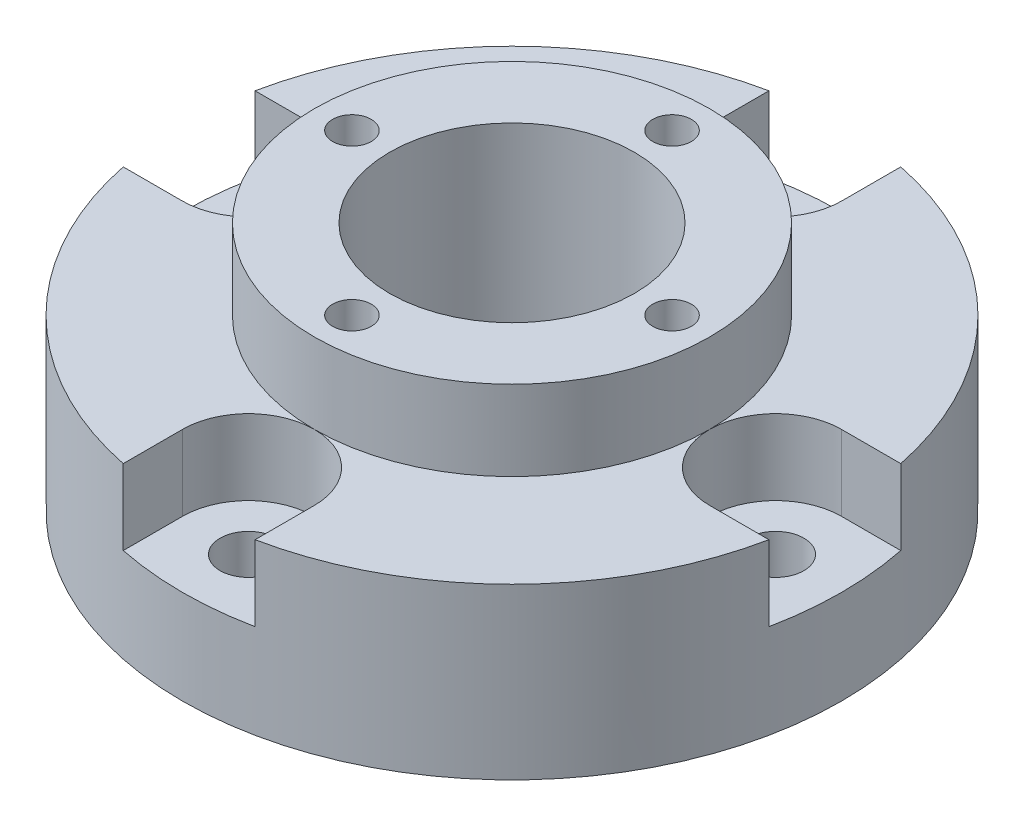
ISO-10303-21;
HEADER;
FILE_DESCRIPTION(('STEP AP214'),'2;1');
FILE_NAME('part.step','',(''),(''),'','','');
FILE_SCHEMA(('AUTOMOTIVE_DESIGN { 1 0 10303 214 1 1 1 1 }'));
ENDSEC;
DATA;
#1=APPLICATION_CONTEXT('core data for automotive mechanical design processes');
#2=APPLICATION_PROTOCOL_DEFINITION('international standard','automotive_design',2000,#1);
#3=PRODUCT_CONTEXT('',#1,'mechanical');
#4=PRODUCT('Part','Part','',(#3));
#5=PRODUCT_RELATED_PRODUCT_CATEGORY('part','',(#4));
#6=PRODUCT_DEFINITION_FORMATION('','',#4);
#7=PRODUCT_DEFINITION_CONTEXT('part definition',#1,'design');
#8=PRODUCT_DEFINITION('design','',#6,#7);
#9=PRODUCT_DEFINITION_SHAPE('','',#8);
#10=(LENGTH_UNIT() NAMED_UNIT(*) SI_UNIT(.MILLI.,.METRE.));
#11=(NAMED_UNIT(*) PLANE_ANGLE_UNIT() SI_UNIT($,.RADIAN.));
#12=(NAMED_UNIT(*) SI_UNIT($,.STERADIAN.) SOLID_ANGLE_UNIT());
#13=UNCERTAINTY_MEASURE_WITH_UNIT(LENGTH_MEASURE(1.E-05),#10,'distance_accuracy_value','');
#14=(GEOMETRIC_REPRESENTATION_CONTEXT(3) GLOBAL_UNCERTAINTY_ASSIGNED_CONTEXT((#13)) GLOBAL_UNIT_ASSIGNED_CONTEXT((#10,
#11,#12)) REPRESENTATION_CONTEXT('',''));
#15=CARTESIAN_POINT('',(0.,0.,0.));
#16=DIRECTION('',(0.,0.,1.));
#17=DIRECTION('',(1.,0.,0.));
#18=AXIS2_PLACEMENT_3D('',#15,#16,#17);
#19=CARTESIAN_POINT('',(-21.,18.,0.));
#20=DIRECTION('',(0.,-1.,0.));
#21=DIRECTION('',(0.,0.,-1.));
#22=AXIS2_PLACEMENT_3D('',#19,#20,#21);
#23=PLANE('',#22);
#24=CARTESIAN_POINT('',(-28.,18.,0.));
#25=DIRECTION('',(0.,1.,0.));
#26=DIRECTION('',(0.,0.,-1.));
#27=AXIS2_PLACEMENT_3D('',#24,#25,#26);
#28=CIRCLE('',#27,7.);
#29=CARTESIAN_POINT('',(-28.,18.,7.));
#30=VERTEX_POINT('',#29);
#31=CARTESIAN_POINT('',(-21.,18.,0.));
#32=VERTEX_POINT('',#31);
#33=EDGE_CURVE('E186',#30,#32,#28,.T.);
#34=ORIENTED_EDGE('',*,*,#33,.F.);
#35=DIRECTION('',(1.,0.,0.));
#36=VECTOR('',#35,1.);
#37=CARTESIAN_POINT('',(-28.,18.,7.));
#38=LINE('',#37,#36);
#39=CARTESIAN_POINT('',(-34.2928563989645,18.,7.));
#40=VERTEX_POINT('',#39);
#41=EDGE_CURVE('E180',#40,#30,#38,.T.);
#42=ORIENTED_EDGE('',*,*,#41,.F.);
#43=CARTESIAN_POINT('',(0.,18.,0.));
#44=DIRECTION('',(0.,-1.,0.));
#45=DIRECTION('',(0.,0.,-1.));
#46=AXIS2_PLACEMENT_3D('',#43,#44,#45);
#47=CIRCLE('',#46,35.);
#48=CARTESIAN_POINT('',(-7.00000000000012,18.,34.2928563989645));
#49=VERTEX_POINT('',#48);
#50=EDGE_CURVE('E305',#49,#40,#47,.T.);
#51=ORIENTED_EDGE('',*,*,#50,.F.);
#52=DIRECTION('',(0.,0.,1.));
#53=VECTOR('',#52,1.);
#54=CARTESIAN_POINT('',(-7.0000000000001,18.,28.));
#55=LINE('',#54,#53);
#56=CARTESIAN_POINT('',(-7.0000000000001,18.,28.));
#57=VERTEX_POINT('',#56);
#58=EDGE_CURVE('E226',#57,#49,#55,.T.);
#59=ORIENTED_EDGE('',*,*,#58,.F.);
#60=CARTESIAN_POINT('',(0.,18.,28.));
#61=DIRECTION('',(0.,1.,0.));
#62=DIRECTION('',(-1.,0.,0.));
#63=AXIS2_PLACEMENT_3D('',#60,#61,#62);
#64=CIRCLE('',#63,7.);
#65=CARTESIAN_POINT('',(0.,18.,21.));
#66=VERTEX_POINT('',#65);
#67=EDGE_CURVE('E214',#66,#57,#64,.T.);
#68=ORIENTED_EDGE('',*,*,#67,.F.);
#69=CARTESIAN_POINT('',(0.,18.,0.));
#70=DIRECTION('',(0.,-1.,0.));
#71=DIRECTION('',(0.,0.,-1.));
#72=AXIS2_PLACEMENT_3D('',#69,#70,#71);
#73=CIRCLE('',#72,21.);
#74=EDGE_CURVE('E310',#66,#32,#73,.T.);
#75=ORIENTED_EDGE('',*,*,#74,.T.);
#76=EDGE_LOOP('',(#34,#42,#51,#59,#68,#75));
#77=FACE_BOUND('',#76,.T.);
#78=ADVANCED_FACE('F35',(#77),#23,.F.);
#79=DIRECTION('',(-1.,0.,0.));
#80=VECTOR('',#79,1.);
#81=CARTESIAN_POINT('',(-28.,18.,-7.));
#82=LINE('',#81,#80);
#83=CARTESIAN_POINT('',(-28.,18.,-7.));
#84=VERTEX_POINT('',#83);
#85=CARTESIAN_POINT('',(-34.2928563989645,18.,-7.));
#86=VERTEX_POINT('',#85);
#87=EDGE_CURVE('E182',#84,#86,#82,.T.);
#88=ORIENTED_EDGE('',*,*,#87,.F.);
#89=EDGE_CURVE('E167',#32,#84,#28,.T.);
#90=ORIENTED_EDGE('',*,*,#89,.F.);
#91=CARTESIAN_POINT('',(2.19963324347117E-13,18.,-21.));
#92=VERTEX_POINT('',#91);
#93=EDGE_CURVE('E387',#32,#92,#73,.T.);
#94=ORIENTED_EDGE('',*,*,#93,.T.);
#95=CARTESIAN_POINT('',(2.93284432462823E-13,18.,-28.));
#96=DIRECTION('',(0.,1.,0.));
#97=DIRECTION('',(1.,0.,0.));
#98=AXIS2_PLACEMENT_3D('',#95,#96,#97);
#99=CIRCLE('',#98,7.);
#100=CARTESIAN_POINT('',(-6.99999999999971,18.,-28.0000000000001));
#101=VERTEX_POINT('',#100);
#102=EDGE_CURVE('E198',#101,#92,#99,.T.);
#103=ORIENTED_EDGE('',*,*,#102,.F.);
#104=DIRECTION('',(0.,0.,1.));
#105=VECTOR('',#104,1.);
#106=CARTESIAN_POINT('',(-6.99999999999971,18.,-28.0000000000001));
#107=LINE('',#106,#105);
#108=CARTESIAN_POINT('',(-6.99999999999964,18.,-34.2928563989646));
#109=VERTEX_POINT('',#108);
#110=EDGE_CURVE('E193',#109,#101,#107,.T.);
#111=ORIENTED_EDGE('',*,*,#110,.F.);
#112=EDGE_CURVE('E350',#86,#109,#47,.T.);
#113=ORIENTED_EDGE('',*,*,#112,.F.);
#114=EDGE_LOOP('',(#88,#90,#94,#103,#111,#113));
#115=FACE_BOUND('',#114,.T.);
#116=ADVANCED_FACE('F353',(#115),#23,.F.);
#117=CARTESIAN_POINT('',(-28.,18.,0.));
#118=DIRECTION('',(0.,1.,0.));
#119=DIRECTION('',(0.,0.,1.));
#120=AXIS2_PLACEMENT_3D('',#117,#118,#119);
#121=CYLINDRICAL_SURFACE('',#120,3.);
#122=CARTESIAN_POINT('',(-28.,0.,0.));
#123=DIRECTION('',(0.,1.,0.));
#124=DIRECTION('',(0.,0.,1.));
#125=AXIS2_PLACEMENT_3D('',#122,#123,#124);
#126=CIRCLE('',#125,3.);
#127=CARTESIAN_POINT('',(-28.,0.,3.));
#128=VERTEX_POINT('',#127);
#129=EDGE_CURVE('E240',#128,#128,#126,.T.);
#130=ORIENTED_EDGE('',*,*,#129,.F.);
#131=EDGE_LOOP('',(#130));
#132=FACE_BOUND('',#131,.T.);
#133=CARTESIAN_POINT('',(-28.,10.,0.));
#134=DIRECTION('',(0.,1.,0.));
#135=DIRECTION('',(0.,0.,1.));
#136=AXIS2_PLACEMENT_3D('',#133,#134,#135);
#137=CIRCLE('',#136,3.);
#138=CARTESIAN_POINT('',(-28.,10.,3.));
#139=VERTEX_POINT('',#138);
#140=EDGE_CURVE('E211',#139,#139,#137,.F.);
#141=ORIENTED_EDGE('',*,*,#140,.F.);
#142=EDGE_LOOP('',(#141));
#143=FACE_BOUND('',#142,.T.);
#144=ADVANCED_FACE('F418',(#132,#143),#121,.F.);
#145=CARTESIAN_POINT('',(2.93284432462823E-13,18.,-28.));
#146=DIRECTION('',(0.,1.,0.));
#147=DIRECTION('',(0.,0.,1.));
#148=AXIS2_PLACEMENT_3D('',#145,#146,#147);
#149=CYLINDRICAL_SURFACE('',#148,3.);
#150=CARTESIAN_POINT('',(2.93284432462823E-13,0.,-28.));
#151=DIRECTION('',(0.,1.,0.));
#152=DIRECTION('',(0.,0.,1.));
#153=AXIS2_PLACEMENT_3D('',#150,#151,#152);
#154=CIRCLE('',#153,3.);
#155=CARTESIAN_POINT('',(2.93284432462823E-13,0.,-25.));
#156=VERTEX_POINT('',#155);
#157=EDGE_CURVE('E237',#156,#156,#154,.T.);
#158=ORIENTED_EDGE('',*,*,#157,.F.);
#159=EDGE_LOOP('',(#158));
#160=FACE_BOUND('',#159,.T.);
#161=CARTESIAN_POINT('',(2.93284432462823E-13,10.,-28.));
#162=DIRECTION('',(0.,1.,0.));
#163=DIRECTION('',(0.,0.,1.));
#164=AXIS2_PLACEMENT_3D('',#161,#162,#163);
#165=CIRCLE('',#164,3.);
#166=CARTESIAN_POINT('',(2.93284432462823E-13,10.,-25.));
#167=VERTEX_POINT('',#166);
#168=EDGE_CURVE('E189',#167,#167,#165,.F.);
#169=ORIENTED_EDGE('',*,*,#168,.F.);
#170=EDGE_LOOP('',(#169));
#171=FACE_BOUND('',#170,.T.);
#172=ADVANCED_FACE('F430',(#160,#171),#149,.F.);
#173=CARTESIAN_POINT('',(6.9999999999999,18.,28.));
#174=VERTEX_POINT('',#173);
#175=EDGE_CURVE('E224',#174,#66,#64,.T.);
#176=ORIENTED_EDGE('',*,*,#175,.F.);
#177=DIRECTION('',(0.,0.,-1.));
#178=VECTOR('',#177,1.);
#179=CARTESIAN_POINT('',(6.9999999999999,18.,28.));
#180=LINE('',#179,#178);
#181=CARTESIAN_POINT('',(6.99999999999988,18.,34.2928563989645));
#182=VERTEX_POINT('',#181);
#183=EDGE_CURVE('E219',#182,#174,#180,.T.);
#184=ORIENTED_EDGE('',*,*,#183,.F.);
#185=CARTESIAN_POINT('',(34.2928563989645,18.,7.));
#186=VERTEX_POINT('',#185);
#187=EDGE_CURVE('E301',#186,#182,#47,.T.);
#188=ORIENTED_EDGE('',*,*,#187,.F.);
#189=DIRECTION('',(1.,0.,0.));
#190=VECTOR('',#189,1.);
#191=CARTESIAN_POINT('',(28.,18.,7.));
#192=LINE('',#191,#190);
#193=CARTESIAN_POINT('',(28.,18.,7.));
#194=VERTEX_POINT('',#193);
#195=EDGE_CURVE('E277',#194,#186,#192,.T.);
#196=ORIENTED_EDGE('',*,*,#195,.F.);
#197=CARTESIAN_POINT('',(28.,18.,0.));
#198=DIRECTION('',(0.,1.,0.));
#199=DIRECTION('',(0.,0.,1.));
#200=AXIS2_PLACEMENT_3D('',#197,#198,#199);
#201=CIRCLE('',#200,7.);
#202=CARTESIAN_POINT('',(21.,18.,0.));
#203=VERTEX_POINT('',#202);
#204=EDGE_CURVE('E264',#203,#194,#201,.T.);
#205=ORIENTED_EDGE('',*,*,#204,.F.);
#206=EDGE_CURVE('E306',#203,#66,#73,.T.);
#207=ORIENTED_EDGE('',*,*,#206,.T.);
#208=EDGE_LOOP('',(#176,#184,#188,#196,#205,#207));
#209=FACE_BOUND('',#208,.T.);
#210=ADVANCED_FACE('F378',(#209),#23,.F.);
#211=CARTESIAN_POINT('',(0.,18.,28.));
#212=DIRECTION('',(0.,1.,0.));
#213=DIRECTION('',(0.,0.,1.));
#214=AXIS2_PLACEMENT_3D('',#211,#212,#213);
#215=CYLINDRICAL_SURFACE('',#214,3.);
#216=CARTESIAN_POINT('',(0.,0.,28.));
#217=DIRECTION('',(0.,1.,0.));
#218=DIRECTION('',(0.,0.,1.));
#219=AXIS2_PLACEMENT_3D('',#216,#217,#218);
#220=CIRCLE('',#219,3.);
#221=CARTESIAN_POINT('',(0.,0.,31.));
#222=VERTEX_POINT('',#221);
#223=EDGE_CURVE('E243',#222,#222,#220,.T.);
#224=ORIENTED_EDGE('',*,*,#223,.F.);
#225=EDGE_LOOP('',(#224));
#226=FACE_BOUND('',#225,.T.);
#227=CARTESIAN_POINT('',(0.,10.,28.));
#228=DIRECTION('',(0.,1.,0.));
#229=DIRECTION('',(0.,0.,1.));
#230=AXIS2_PLACEMENT_3D('',#227,#228,#229);
#231=CIRCLE('',#230,3.);
#232=CARTESIAN_POINT('',(0.,10.,31.));
#233=VERTEX_POINT('',#232);
#234=EDGE_CURVE('E232',#233,#233,#231,.F.);
#235=ORIENTED_EDGE('',*,*,#234,.F.);
#236=EDGE_LOOP('',(#235));
#237=FACE_BOUND('',#236,.T.);
#238=ADVANCED_FACE('F429',(#226,#237),#215,.F.);
#239=CARTESIAN_POINT('',(28.,18.,0.));
#240=DIRECTION('',(0.,1.,0.));
#241=DIRECTION('',(0.,0.,1.));
#242=AXIS2_PLACEMENT_3D('',#239,#240,#241);
#243=CYLINDRICAL_SURFACE('',#242,3.);
#244=CARTESIAN_POINT('',(28.,0.,0.));
#245=DIRECTION('',(0.,1.,0.));
#246=DIRECTION('',(0.,0.,1.));
#247=AXIS2_PLACEMENT_3D('',#244,#245,#246);
#248=CIRCLE('',#247,3.);
#249=CARTESIAN_POINT('',(28.,0.,3.));
#250=VERTEX_POINT('',#249);
#251=EDGE_CURVE('E288',#250,#250,#248,.T.);
#252=ORIENTED_EDGE('',*,*,#251,.F.);
#253=EDGE_LOOP('',(#252));
#254=FACE_BOUND('',#253,.T.);
#255=CARTESIAN_POINT('',(28.,10.,0.));
#256=DIRECTION('',(0.,1.,0.));
#257=DIRECTION('',(0.,0.,1.));
#258=AXIS2_PLACEMENT_3D('',#255,#256,#257);
#259=CIRCLE('',#258,3.);
#260=CARTESIAN_POINT('',(28.,10.,3.));
#261=VERTEX_POINT('',#260);
#262=EDGE_CURVE('E283',#261,#261,#259,.F.);
#263=ORIENTED_EDGE('',*,*,#262,.F.);
#264=EDGE_LOOP('',(#263));
#265=FACE_BOUND('',#264,.T.);
#266=ADVANCED_FACE('F435',(#254,#265),#243,.F.);
#267=CARTESIAN_POINT('',(-35.,0.,0.));
#268=DIRECTION('',(0.,1.,0.));
#269=DIRECTION('',(0.,0.,1.));
#270=AXIS2_PLACEMENT_3D('',#267,#268,#269);
#271=PLANE('',#270);
#272=ORIENTED_EDGE('',*,*,#157,.T.);
#273=EDGE_LOOP('',(#272));
#274=FACE_BOUND('',#273,.T.);
#275=ORIENTED_EDGE('',*,*,#129,.T.);
#276=EDGE_LOOP('',(#275));
#277=FACE_BOUND('',#276,.T.);
#278=ORIENTED_EDGE('',*,*,#223,.T.);
#279=EDGE_LOOP('',(#278));
#280=FACE_BOUND('',#279,.T.);
#281=CARTESIAN_POINT('',(1.78065548281E-13,0.,-17.));
#282=DIRECTION('',(0.,1.,0.));
#283=DIRECTION('',(0.,0.,1.));
#284=AXIS2_PLACEMENT_3D('',#281,#282,#283);
#285=CIRCLE('',#284,2.05);
#286=CARTESIAN_POINT('',(1.78065548281E-13,0.,-14.95));
#287=VERTEX_POINT('',#286);
#288=EDGE_CURVE('E249',#287,#287,#285,.T.);
#289=ORIENTED_EDGE('',*,*,#288,.T.);
#290=EDGE_LOOP('',(#289));
#291=FACE_BOUND('',#290,.T.);
#292=CARTESIAN_POINT('',(-17.,0.,0.));
#293=DIRECTION('',(0.,1.,0.));
#294=DIRECTION('',(0.,0.,1.));
#295=AXIS2_PLACEMENT_3D('',#292,#293,#294);
#296=CIRCLE('',#295,2.04999999999999);
#297=CARTESIAN_POINT('',(-17.,0.,2.04999999999999));
#298=VERTEX_POINT('',#297);
#299=EDGE_CURVE('E255',#298,#298,#296,.T.);
#300=ORIENTED_EDGE('',*,*,#299,.T.);
#301=EDGE_LOOP('',(#300));
#302=FACE_BOUND('',#301,.T.);
#303=CARTESIAN_POINT('',(0.,0.,17.));
#304=DIRECTION('',(0.,1.,0.));
#305=DIRECTION('',(0.,0.,1.));
#306=AXIS2_PLACEMENT_3D('',#303,#304,#305);
#307=CIRCLE('',#306,2.05);
#308=CARTESIAN_POINT('',(0.,0.,19.05));
#309=VERTEX_POINT('',#308);
#310=EDGE_CURVE('E261',#309,#309,#307,.T.);
#311=ORIENTED_EDGE('',*,*,#310,.T.);
#312=EDGE_LOOP('',(#311));
#313=FACE_BOUND('',#312,.T.);
#314=ORIENTED_EDGE('',*,*,#251,.T.);
#315=EDGE_LOOP('',(#314));
#316=FACE_BOUND('',#315,.T.);
#317=CARTESIAN_POINT('',(17.,0.,0.));
#318=DIRECTION('',(0.,1.,0.));
#319=DIRECTION('',(0.,0.,1.));
#320=AXIS2_PLACEMENT_3D('',#317,#318,#319);
#321=CIRCLE('',#320,2.04999999999999);
#322=CARTESIAN_POINT('',(17.,0.,2.04999999999999));
#323=VERTEX_POINT('',#322);
#324=EDGE_CURVE('E294',#323,#323,#321,.T.);
#325=ORIENTED_EDGE('',*,*,#324,.T.);
#326=EDGE_LOOP('',(#325));
#327=FACE_BOUND('',#326,.T.);
#328=CARTESIAN_POINT('',(0.,0.,0.));
#329=DIRECTION('',(0.,-1.,0.));
#330=DIRECTION('',(0.,0.,-1.));
#331=AXIS2_PLACEMENT_3D('',#328,#329,#330);
#332=CIRCLE('',#331,13.);
#333=CARTESIAN_POINT('',(0.,0.,-13.));
#334=VERTEX_POINT('',#333);
#335=EDGE_CURVE('E316',#334,#334,#332,.T.);
#336=ORIENTED_EDGE('',*,*,#335,.F.);
#337=EDGE_LOOP('',(#336));
#338=FACE_BOUND('',#337,.T.);
#339=CARTESIAN_POINT('',(0.,0.,0.));
#340=DIRECTION('',(0.,-1.,0.));
#341=DIRECTION('',(0.,0.,-1.));
#342=AXIS2_PLACEMENT_3D('',#339,#340,#341);
#343=CIRCLE('',#342,35.);
#344=CARTESIAN_POINT('',(0.,0.,-35.));
#345=VERTEX_POINT('',#344);
#346=EDGE_CURVE('E297',#345,#345,#343,.T.);
#347=ORIENTED_EDGE('',*,*,#346,.T.);
#348=EDGE_LOOP('',(#347));
#349=FACE_BOUND('',#348,.T.);
#350=ADVANCED_FACE('F37',(#274,#277,#280,#291,#302,#313,#316,#327,#338,#349),#271,.F.);
#351=CARTESIAN_POINT('',(0.,0.,0.));
#352=DIRECTION('',(0.,-1.,0.));
#353=DIRECTION('',(0.,0.,-1.));
#354=AXIS2_PLACEMENT_3D('',#351,#352,#353);
#355=CYLINDRICAL_SURFACE('',#354,13.);
#356=CARTESIAN_POINT('',(0.,26.5,0.));
#357=DIRECTION('',(0.,-1.,0.));
#358=DIRECTION('',(0.,0.,-1.));
#359=AXIS2_PLACEMENT_3D('',#356,#357,#358);
#360=CIRCLE('',#359,13.);
#361=CARTESIAN_POINT('',(0.,26.5,-13.));
#362=VERTEX_POINT('',#361);
#363=EDGE_CURVE('E313',#362,#362,#360,.T.);
#364=ORIENTED_EDGE('',*,*,#363,.F.);
#365=EDGE_LOOP('',(#364));
#366=FACE_BOUND('',#365,.T.);
#367=ORIENTED_EDGE('',*,*,#335,.T.);
#368=EDGE_LOOP('',(#367));
#369=FACE_BOUND('',#368,.T.);
#370=ADVANCED_FACE('F487',(#366,#369),#355,.F.);
#371=CARTESIAN_POINT('',(-13.,26.5,0.));
#372=DIRECTION('',(0.,-1.,0.));
#373=DIRECTION('',(0.,0.,-1.));
#374=AXIS2_PLACEMENT_3D('',#371,#372,#373);
#375=PLANE('',#374);
#376=CARTESIAN_POINT('',(1.78065548281E-13,26.5,-17.));
#377=DIRECTION('',(0.,1.,0.));
#378=DIRECTION('',(0.,0.,1.));
#379=AXIS2_PLACEMENT_3D('',#376,#377,#378);
#380=CIRCLE('',#379,2.05);
#381=CARTESIAN_POINT('',(1.78065548281E-13,26.5,-14.95));
#382=VERTEX_POINT('',#381);
#383=EDGE_CURVE('E246',#382,#382,#380,.T.);
#384=ORIENTED_EDGE('',*,*,#383,.F.);
#385=EDGE_LOOP('',(#384));
#386=FACE_BOUND('',#385,.T.);
#387=CARTESIAN_POINT('',(-17.,26.5,0.));
#388=DIRECTION('',(0.,1.,0.));
#389=DIRECTION('',(0.,0.,1.));
#390=AXIS2_PLACEMENT_3D('',#387,#388,#389);
#391=CIRCLE('',#390,2.05);
#392=CARTESIAN_POINT('',(-17.,26.5,2.05));
#393=VERTEX_POINT('',#392);
#394=EDGE_CURVE('E252',#393,#393,#391,.T.);
#395=ORIENTED_EDGE('',*,*,#394,.F.);
#396=EDGE_LOOP('',(#395));
#397=FACE_BOUND('',#396,.T.);
#398=CARTESIAN_POINT('',(0.,26.5,17.));
#399=DIRECTION('',(0.,1.,0.));
#400=DIRECTION('',(0.,0.,1.));
#401=AXIS2_PLACEMENT_3D('',#398,#399,#400);
#402=CIRCLE('',#401,2.05);
#403=CARTESIAN_POINT('',(0.,26.5,19.05));
#404=VERTEX_POINT('',#403);
#405=EDGE_CURVE('E258',#404,#404,#402,.T.);
#406=ORIENTED_EDGE('',*,*,#405,.F.);
#407=EDGE_LOOP('',(#406));
#408=FACE_BOUND('',#407,.T.);
#409=CARTESIAN_POINT('',(17.,26.5,0.));
#410=DIRECTION('',(0.,1.,0.));
#411=DIRECTION('',(0.,0.,1.));
#412=AXIS2_PLACEMENT_3D('',#409,#410,#411);
#413=CIRCLE('',#412,2.05);
#414=CARTESIAN_POINT('',(17.,26.5,2.05));
#415=VERTEX_POINT('',#414);
#416=EDGE_CURVE('E291',#415,#415,#413,.T.);
#417=ORIENTED_EDGE('',*,*,#416,.F.);
#418=EDGE_LOOP('',(#417));
#419=FACE_BOUND('',#418,.T.);
#420=CARTESIAN_POINT('',(0.,26.5,0.));
#421=DIRECTION('',(0.,-1.,0.));
#422=DIRECTION('',(0.,0.,-1.));
#423=AXIS2_PLACEMENT_3D('',#420,#421,#422);
#424=CIRCLE('',#423,21.);
#425=CARTESIAN_POINT('',(0.,26.5,-21.));
#426=VERTEX_POINT('',#425);
#427=EDGE_CURVE('E309',#426,#426,#424,.T.);
#428=ORIENTED_EDGE('',*,*,#427,.F.);
#429=EDGE_LOOP('',(#428));
#430=FACE_BOUND('',#429,.T.);
#431=ORIENTED_EDGE('',*,*,#363,.T.);
#432=EDGE_LOOP('',(#431));
#433=FACE_BOUND('',#432,.T.);
#434=ADVANCED_FACE('F427',(#386,#397,#408,#419,#430,#433),#375,.F.);
#435=CARTESIAN_POINT('',(0.,0.,0.));
#436=DIRECTION('',(0.,-1.,0.));
#437=DIRECTION('',(0.,0.,-1.));
#438=AXIS2_PLACEMENT_3D('',#435,#436,#437);
#439=CYLINDRICAL_SURFACE('',#438,21.);
#440=ORIENTED_EDGE('',*,*,#206,.F.);
#441=EDGE_CURVE('E304',#92,#203,#73,.T.);
#442=ORIENTED_EDGE('',*,*,#441,.F.);
#443=ORIENTED_EDGE('',*,*,#93,.F.);
#444=ORIENTED_EDGE('',*,*,#74,.F.);
#445=EDGE_LOOP('',(#440,#442,#443,#444));
#446=FACE_BOUND('',#445,.T.);
#447=ORIENTED_EDGE('',*,*,#427,.T.);
#448=EDGE_LOOP('',(#447));
#449=FACE_BOUND('',#448,.T.);
#450=ADVANCED_FACE('F382',(#446,#449),#439,.T.);
#451=DIRECTION('',(0.,0.,-1.));
#452=VECTOR('',#451,1.);
#453=CARTESIAN_POINT('',(7.00000000000029,18.,-27.9999999999999));
#454=LINE('',#453,#452);
#455=CARTESIAN_POINT('',(7.00000000000029,18.,-27.9999999999999));
#456=VERTEX_POINT('',#455);
#457=CARTESIAN_POINT('',(7.00000000000036,18.,-34.2928563989644));
#458=VERTEX_POINT('',#457);
#459=EDGE_CURVE('E200',#456,#458,#454,.T.);
#460=ORIENTED_EDGE('',*,*,#459,.F.);
#461=EDGE_CURVE('E201',#92,#456,#99,.T.);
#462=ORIENTED_EDGE('',*,*,#461,.F.);
#463=ORIENTED_EDGE('',*,*,#441,.T.);
#464=CARTESIAN_POINT('',(28.,18.,-7.));
#465=VERTEX_POINT('',#464);
#466=EDGE_CURVE('E274',#465,#203,#201,.T.);
#467=ORIENTED_EDGE('',*,*,#466,.F.);
#468=DIRECTION('',(-1.,0.,0.));
#469=VECTOR('',#468,1.);
#470=CARTESIAN_POINT('',(28.,18.,-7.));
#471=LINE('',#470,#469);
#472=CARTESIAN_POINT('',(34.2928563989645,18.,-7.));
#473=VERTEX_POINT('',#472);
#474=EDGE_CURVE('E269',#473,#465,#471,.T.);
#475=ORIENTED_EDGE('',*,*,#474,.F.);
#476=EDGE_CURVE('E300',#458,#473,#47,.T.);
#477=ORIENTED_EDGE('',*,*,#476,.F.);
#478=EDGE_LOOP('',(#460,#462,#463,#467,#475,#477));
#479=FACE_BOUND('',#478,.T.);
#480=ADVANCED_FACE('F367',(#479),#23,.F.);
#481=CARTESIAN_POINT('',(0.,0.,0.));
#482=DIRECTION('',(0.,-1.,0.));
#483=DIRECTION('',(0.,0.,-1.));
#484=AXIS2_PLACEMENT_3D('',#481,#482,#483);
#485=CYLINDRICAL_SURFACE('',#484,35.);
#486=ORIENTED_EDGE('',*,*,#50,.T.);
#487=DIRECTION('',(0.,-1.,0.));
#488=VECTOR('',#487,1.);
#489=CARTESIAN_POINT('',(-34.2928563989645,0.,7.));
#490=LINE('',#489,#488);
#491=CARTESIAN_POINT('',(-34.2928563989645,10.,7.));
#492=VERTEX_POINT('',#491);
#493=EDGE_CURVE('E11',#40,#492,#490,.T.);
#494=ORIENTED_EDGE('',*,*,#493,.T.);
#495=CARTESIAN_POINT('',(0.,10.,0.));
#496=DIRECTION('',(0.,1.,0.));
#497=DIRECTION('',(0.,0.,1.));
#498=AXIS2_PLACEMENT_3D('',#495,#496,#497);
#499=CIRCLE('',#498,35.);
#500=CARTESIAN_POINT('',(-34.2928563989645,10.,-7.));
#501=VERTEX_POINT('',#500);
#502=EDGE_CURVE('E212',#501,#492,#499,.T.);
#503=ORIENTED_EDGE('',*,*,#502,.F.);
#504=DIRECTION('',(0.,-1.,0.));
#505=VECTOR('',#504,1.);
#506=CARTESIAN_POINT('',(-34.2928563989645,0.,-7.));
#507=LINE('',#506,#505);
#508=EDGE_CURVE('E43',#501,#86,#507,.F.);
#509=ORIENTED_EDGE('',*,*,#508,.T.);
#510=ORIENTED_EDGE('',*,*,#112,.T.);
#511=DIRECTION('',(0.,-1.,0.));
#512=VECTOR('',#511,1.);
#513=CARTESIAN_POINT('',(-6.99999999999964,0.,-34.2928563989646));
#514=LINE('',#513,#512);
#515=CARTESIAN_POINT('',(-6.99999999999964,10.,-34.2928563989646));
#516=VERTEX_POINT('',#515);
#517=EDGE_CURVE('E342',#109,#516,#514,.T.);
#518=ORIENTED_EDGE('',*,*,#517,.T.);
#519=CARTESIAN_POINT('',(0.,10.,0.));
#520=DIRECTION('',(0.,1.,0.));
#521=DIRECTION('',(0.,0.,1.));
#522=AXIS2_PLACEMENT_3D('',#519,#520,#521);
#523=CIRCLE('',#522,35.);
#524=CARTESIAN_POINT('',(7.00000000000036,10.,-34.2928563989644));
#525=VERTEX_POINT('',#524);
#526=EDGE_CURVE('E209',#525,#516,#523,.T.);
#527=ORIENTED_EDGE('',*,*,#526,.F.);
#528=DIRECTION('',(0.,-1.,0.));
#529=VECTOR('',#528,1.);
#530=CARTESIAN_POINT('',(7.00000000000036,0.,-34.2928563989644));
#531=LINE('',#530,#529);
#532=EDGE_CURVE('E335',#525,#458,#531,.F.);
#533=ORIENTED_EDGE('',*,*,#532,.T.);
#534=ORIENTED_EDGE('',*,*,#476,.T.);
#535=DIRECTION('',(0.,-1.,0.));
#536=VECTOR('',#535,1.);
#537=CARTESIAN_POINT('',(34.2928563989645,0.,-7.));
#538=LINE('',#537,#536);
#539=CARTESIAN_POINT('',(34.2928563989645,10.,-7.));
#540=VERTEX_POINT('',#539);
#541=EDGE_CURVE('E324',#473,#540,#538,.T.);
#542=ORIENTED_EDGE('',*,*,#541,.T.);
#543=CARTESIAN_POINT('',(0.,10.,0.));
#544=DIRECTION('',(0.,1.,0.));
#545=DIRECTION('',(0.,0.,1.));
#546=AXIS2_PLACEMENT_3D('',#543,#544,#545);
#547=CIRCLE('',#546,35.);
#548=CARTESIAN_POINT('',(34.2928563989645,10.,7.));
#549=VERTEX_POINT('',#548);
#550=EDGE_CURVE('E286',#549,#540,#547,.T.);
#551=ORIENTED_EDGE('',*,*,#550,.F.);
#552=DIRECTION('',(0.,-1.,0.));
#553=VECTOR('',#552,1.);
#554=CARTESIAN_POINT('',(34.2928563989645,0.,7.));
#555=LINE('',#554,#553);
#556=EDGE_CURVE('E319',#549,#186,#555,.F.);
#557=ORIENTED_EDGE('',*,*,#556,.T.);
#558=ORIENTED_EDGE('',*,*,#187,.T.);
#559=DIRECTION('',(0.,-1.,0.));
#560=VECTOR('',#559,1.);
#561=CARTESIAN_POINT('',(6.99999999999988,0.,34.2928563989645));
#562=LINE('',#561,#560);
#563=CARTESIAN_POINT('',(6.99999999999988,10.,34.2928563989645));
#564=VERTEX_POINT('',#563);
#565=EDGE_CURVE('E332',#182,#564,#562,.T.);
#566=ORIENTED_EDGE('',*,*,#565,.T.);
#567=CARTESIAN_POINT('',(0.,10.,0.));
#568=DIRECTION('',(0.,1.,0.));
#569=DIRECTION('',(0.,0.,1.));
#570=AXIS2_PLACEMENT_3D('',#567,#568,#569);
#571=CIRCLE('',#570,35.);
#572=CARTESIAN_POINT('',(-7.00000000000012,10.,34.2928563989645));
#573=VERTEX_POINT('',#572);
#574=EDGE_CURVE('E235',#573,#564,#571,.T.);
#575=ORIENTED_EDGE('',*,*,#574,.F.);
#576=DIRECTION('',(0.,-1.,0.));
#577=VECTOR('',#576,1.);
#578=CARTESIAN_POINT('',(-7.00000000000012,0.,34.2928563989645));
#579=LINE('',#578,#577);
#580=EDGE_CURVE('E327',#573,#49,#579,.F.);
#581=ORIENTED_EDGE('',*,*,#580,.T.);
#582=EDGE_LOOP('',(#486,#494,#503,#509,#510,#518,#527,#533,#534,#542,#551,#557,#558,#566,#575,#581));
#583=FACE_BOUND('',#582,.T.);
#584=ORIENTED_EDGE('',*,*,#346,.F.);
#585=EDGE_LOOP('',(#584));
#586=FACE_BOUND('',#585,.T.);
#587=ADVANCED_FACE('F348',(#583,#586),#485,.T.);
#588=CARTESIAN_POINT('',(17.,26.5,0.));
#589=DIRECTION('',(0.,1.,0.));
#590=DIRECTION('',(0.,0.,1.));
#591=AXIS2_PLACEMENT_3D('',#588,#589,#590);
#592=CYLINDRICAL_SURFACE('',#591,2.04999999999999);
#593=ORIENTED_EDGE('',*,*,#324,.F.);
#594=EDGE_LOOP('',(#593));
#595=FACE_BOUND('',#594,.T.);
#596=ORIENTED_EDGE('',*,*,#416,.T.);
#597=EDGE_LOOP('',(#596));
#598=FACE_BOUND('',#597,.T.);
#599=ADVANCED_FACE('F426',(#595,#598),#592,.F.);
#600=CARTESIAN_POINT('',(28.,10.,-7.));
#601=DIRECTION('',(0.,0.,-1.));
#602=DIRECTION('',(-1.,0.,0.));
#603=AXIS2_PLACEMENT_3D('',#600,#601,#602);
#604=PLANE('',#603);
#605=ORIENTED_EDGE('',*,*,#474,.T.);
#606=DIRECTION('',(0.,1.,0.));
#607=VECTOR('',#606,1.);
#608=CARTESIAN_POINT('',(28.,10.,-7.));
#609=LINE('',#608,#607);
#610=CARTESIAN_POINT('',(28.,10.,-7.));
#611=VERTEX_POINT('',#610);
#612=EDGE_CURVE('E280',#611,#465,#609,.T.);
#613=ORIENTED_EDGE('',*,*,#612,.F.);
#614=DIRECTION('',(-1.,0.,0.));
#615=VECTOR('',#614,1.);
#616=CARTESIAN_POINT('',(28.,10.,-7.));
#617=LINE('',#616,#615);
#618=EDGE_CURVE('E271',#540,#611,#617,.T.);
#619=ORIENTED_EDGE('',*,*,#618,.F.);
#620=ORIENTED_EDGE('',*,*,#541,.F.);
#621=EDGE_LOOP('',(#605,#613,#619,#620));
#622=FACE_BOUND('',#621,.T.);
#623=ADVANCED_FACE('F364',(#622),#604,.F.);
#624=CARTESIAN_POINT('',(28.,10.,7.));
#625=DIRECTION('',(0.,0.,1.));
#626=DIRECTION('',(1.,0.,0.));
#627=AXIS2_PLACEMENT_3D('',#624,#625,#626);
#628=PLANE('',#627);
#629=DIRECTION('',(1.,0.,0.));
#630=VECTOR('',#629,1.);
#631=CARTESIAN_POINT('',(28.,10.,7.));
#632=LINE('',#631,#630);
#633=CARTESIAN_POINT('',(28.,10.,7.));
#634=VERTEX_POINT('',#633);
#635=EDGE_CURVE('E268',#634,#549,#632,.T.);
#636=ORIENTED_EDGE('',*,*,#635,.F.);
#637=DIRECTION('',(0.,1.,0.));
#638=VECTOR('',#637,1.);
#639=CARTESIAN_POINT('',(28.,10.,7.));
#640=LINE('',#639,#638);
#641=EDGE_CURVE('E273',#634,#194,#640,.T.);
#642=ORIENTED_EDGE('',*,*,#641,.T.);
#643=ORIENTED_EDGE('',*,*,#195,.T.);
#644=ORIENTED_EDGE('',*,*,#556,.F.);
#645=EDGE_LOOP('',(#636,#642,#643,#644));
#646=FACE_BOUND('',#645,.T.);
#647=ADVANCED_FACE('F465',(#646),#628,.F.);
#648=CARTESIAN_POINT('',(28.,10.,0.));
#649=DIRECTION('',(0.,1.,0.));
#650=DIRECTION('',(0.,0.,1.));
#651=AXIS2_PLACEMENT_3D('',#648,#649,#650);
#652=PLANE('',#651);
#653=ORIENTED_EDGE('',*,*,#262,.T.);
#654=EDGE_LOOP('',(#653));
#655=FACE_BOUND('',#654,.T.);
#656=ORIENTED_EDGE('',*,*,#550,.T.);
#657=ORIENTED_EDGE('',*,*,#618,.T.);
#658=CARTESIAN_POINT('',(28.,10.,0.));
#659=DIRECTION('',(0.,1.,0.));
#660=DIRECTION('',(0.,0.,1.));
#661=AXIS2_PLACEMENT_3D('',#658,#659,#660);
#662=CIRCLE('',#661,7.);
#663=EDGE_CURVE('E265',#611,#634,#662,.T.);
#664=ORIENTED_EDGE('',*,*,#663,.T.);
#665=ORIENTED_EDGE('',*,*,#635,.T.);
#666=EDGE_LOOP('',(#656,#657,#664,#665));
#667=FACE_BOUND('',#666,.T.);
#668=ADVANCED_FACE('F462',(#655,#667),#652,.T.);
#669=CARTESIAN_POINT('',(28.,10.,0.));
#670=DIRECTION('',(0.,1.,0.));
#671=DIRECTION('',(0.,0.,1.));
#672=AXIS2_PLACEMENT_3D('',#669,#670,#671);
#673=CYLINDRICAL_SURFACE('',#672,7.);
#674=ORIENTED_EDGE('',*,*,#466,.T.);
#675=ORIENTED_EDGE('',*,*,#204,.T.);
#676=ORIENTED_EDGE('',*,*,#641,.F.);
#677=ORIENTED_EDGE('',*,*,#663,.F.);
#678=ORIENTED_EDGE('',*,*,#612,.T.);
#679=EDGE_LOOP('',(#674,#675,#676,#677,#678));
#680=FACE_BOUND('',#679,.T.);
#681=ADVANCED_FACE('F372',(#680),#673,.F.);
#682=CARTESIAN_POINT('',(0.,26.5,17.));
#683=DIRECTION('',(0.,1.,0.));
#684=DIRECTION('',(0.,0.,1.));
#685=AXIS2_PLACEMENT_3D('',#682,#683,#684);
#686=CYLINDRICAL_SURFACE('',#685,2.05);
#687=ORIENTED_EDGE('',*,*,#310,.F.);
#688=EDGE_LOOP('',(#687));
#689=FACE_BOUND('',#688,.T.);
#690=ORIENTED_EDGE('',*,*,#405,.T.);
#691=EDGE_LOOP('',(#690));
#692=FACE_BOUND('',#691,.T.);
#693=ADVANCED_FACE('F457',(#689,#692),#686,.F.);
#694=CARTESIAN_POINT('',(-17.,26.5,0.));
#695=DIRECTION('',(0.,1.,0.));
#696=DIRECTION('',(0.,0.,1.));
#697=AXIS2_PLACEMENT_3D('',#694,#695,#696);
#698=CYLINDRICAL_SURFACE('',#697,2.04999999999999);
#699=ORIENTED_EDGE('',*,*,#299,.F.);
#700=EDGE_LOOP('',(#699));
#701=FACE_BOUND('',#700,.T.);
#702=ORIENTED_EDGE('',*,*,#394,.T.);
#703=EDGE_LOOP('',(#702));
#704=FACE_BOUND('',#703,.T.);
#705=ADVANCED_FACE('F453',(#701,#704),#698,.F.);
#706=CARTESIAN_POINT('',(1.78065548281E-13,26.5,-17.));
#707=DIRECTION('',(0.,1.,0.));
#708=DIRECTION('',(0.,0.,1.));
#709=AXIS2_PLACEMENT_3D('',#706,#707,#708);
#710=CYLINDRICAL_SURFACE('',#709,2.05);
#711=ORIENTED_EDGE('',*,*,#288,.F.);
#712=EDGE_LOOP('',(#711));
#713=FACE_BOUND('',#712,.T.);
#714=ORIENTED_EDGE('',*,*,#383,.T.);
#715=EDGE_LOOP('',(#714));
#716=FACE_BOUND('',#715,.T.);
#717=ADVANCED_FACE('F449',(#713,#716),#710,.F.);
#718=CARTESIAN_POINT('',(6.9999999999999,10.,28.));
#719=DIRECTION('',(1.,0.,0.));
#720=DIRECTION('',(0.,0.,-1.));
#721=AXIS2_PLACEMENT_3D('',#718,#719,#720);
#722=PLANE('',#721);
#723=ORIENTED_EDGE('',*,*,#183,.T.);
#724=DIRECTION('',(0.,1.,0.));
#725=VECTOR('',#724,1.);
#726=CARTESIAN_POINT('',(6.9999999999999,10.,28.));
#727=LINE('',#726,#725);
#728=CARTESIAN_POINT('',(6.9999999999999,10.,28.));
#729=VERTEX_POINT('',#728);
#730=EDGE_CURVE('E229',#729,#174,#727,.T.);
#731=ORIENTED_EDGE('',*,*,#730,.F.);
#732=DIRECTION('',(0.,0.,-1.));
#733=VECTOR('',#732,1.);
#734=CARTESIAN_POINT('',(6.9999999999999,10.,28.));
#735=LINE('',#734,#733);
#736=EDGE_CURVE('E221',#564,#729,#735,.T.);
#737=ORIENTED_EDGE('',*,*,#736,.F.);
#738=ORIENTED_EDGE('',*,*,#565,.F.);
#739=EDGE_LOOP('',(#723,#731,#737,#738));
#740=FACE_BOUND('',#739,.T.);
#741=ADVANCED_FACE('F452',(#740),#722,.F.);
#742=CARTESIAN_POINT('',(-7.0000000000001,10.,28.));
#743=DIRECTION('',(-1.,0.,0.));
#744=DIRECTION('',(0.,0.,1.));
#745=AXIS2_PLACEMENT_3D('',#742,#743,#744);
#746=PLANE('',#745);
#747=DIRECTION('',(0.,0.,1.));
#748=VECTOR('',#747,1.);
#749=CARTESIAN_POINT('',(-7.0000000000001,10.,28.));
#750=LINE('',#749,#748);
#751=CARTESIAN_POINT('',(-7.0000000000001,10.,28.));
#752=VERTEX_POINT('',#751);
#753=EDGE_CURVE('E218',#752,#573,#750,.T.);
#754=ORIENTED_EDGE('',*,*,#753,.F.);
#755=DIRECTION('',(0.,1.,0.));
#756=VECTOR('',#755,1.);
#757=CARTESIAN_POINT('',(-7.0000000000001,10.,28.));
#758=LINE('',#757,#756);
#759=EDGE_CURVE('E223',#752,#57,#758,.T.);
#760=ORIENTED_EDGE('',*,*,#759,.T.);
#761=ORIENTED_EDGE('',*,*,#58,.T.);
#762=ORIENTED_EDGE('',*,*,#580,.F.);
#763=EDGE_LOOP('',(#754,#760,#761,#762));
#764=FACE_BOUND('',#763,.T.);
#765=ADVANCED_FACE('F610',(#764),#746,.F.);
#766=CARTESIAN_POINT('',(0.,10.,28.));
#767=DIRECTION('',(0.,1.,0.));
#768=DIRECTION('',(-1.,0.,0.));
#769=AXIS2_PLACEMENT_3D('',#766,#767,#768);
#770=PLANE('',#769);
#771=ORIENTED_EDGE('',*,*,#234,.T.);
#772=EDGE_LOOP('',(#771));
#773=FACE_BOUND('',#772,.T.);
#774=ORIENTED_EDGE('',*,*,#574,.T.);
#775=ORIENTED_EDGE('',*,*,#736,.T.);
#776=CARTESIAN_POINT('',(0.,10.,28.));
#777=DIRECTION('',(0.,1.,0.));
#778=DIRECTION('',(-1.,0.,0.));
#779=AXIS2_PLACEMENT_3D('',#776,#777,#778);
#780=CIRCLE('',#779,7.);
#781=EDGE_CURVE('E215',#729,#752,#780,.T.);
#782=ORIENTED_EDGE('',*,*,#781,.T.);
#783=ORIENTED_EDGE('',*,*,#753,.T.);
#784=EDGE_LOOP('',(#774,#775,#782,#783));
#785=FACE_BOUND('',#784,.T.);
#786=ADVANCED_FACE('F409',(#773,#785),#770,.T.);
#787=CARTESIAN_POINT('',(0.,10.,28.));
#788=DIRECTION('',(0.,1.,0.));
#789=DIRECTION('',(0.,0.,1.));
#790=AXIS2_PLACEMENT_3D('',#787,#788,#789);
#791=CYLINDRICAL_SURFACE('',#790,7.);
#792=ORIENTED_EDGE('',*,*,#175,.T.);
#793=ORIENTED_EDGE('',*,*,#67,.T.);
#794=ORIENTED_EDGE('',*,*,#759,.F.);
#795=ORIENTED_EDGE('',*,*,#781,.F.);
#796=ORIENTED_EDGE('',*,*,#730,.T.);
#797=EDGE_LOOP('',(#792,#793,#794,#795,#796));
#798=FACE_BOUND('',#797,.T.);
#799=ADVANCED_FACE('F402',(#798),#791,.F.);
#800=CARTESIAN_POINT('',(-6.99999999999971,10.,-28.0000000000001));
#801=DIRECTION('',(-1.,0.,0.));
#802=DIRECTION('',(0.,0.,1.));
#803=AXIS2_PLACEMENT_3D('',#800,#801,#802);
#804=PLANE('',#803);
#805=ORIENTED_EDGE('',*,*,#110,.T.);
#806=DIRECTION('',(0.,1.,0.));
#807=VECTOR('',#806,1.);
#808=CARTESIAN_POINT('',(-6.99999999999971,10.,-28.0000000000001));
#809=LINE('',#808,#807);
#810=CARTESIAN_POINT('',(-6.99999999999971,10.,-28.0000000000001));
#811=VERTEX_POINT('',#810);
#812=EDGE_CURVE('E204',#811,#101,#809,.T.);
#813=ORIENTED_EDGE('',*,*,#812,.F.);
#814=DIRECTION('',(0.,0.,1.));
#815=VECTOR('',#814,1.);
#816=CARTESIAN_POINT('',(-6.99999999999971,10.,-28.0000000000001));
#817=LINE('',#816,#815);
#818=EDGE_CURVE('E195',#516,#811,#817,.T.);
#819=ORIENTED_EDGE('',*,*,#818,.F.);
#820=ORIENTED_EDGE('',*,*,#517,.F.);
#821=EDGE_LOOP('',(#805,#813,#819,#820));
#822=FACE_BOUND('',#821,.T.);
#823=ADVANCED_FACE('F400',(#822),#804,.F.);
#824=CARTESIAN_POINT('',(7.00000000000029,10.,-27.9999999999999));
#825=DIRECTION('',(1.,0.,0.));
#826=DIRECTION('',(0.,0.,-1.));
#827=AXIS2_PLACEMENT_3D('',#824,#825,#826);
#828=PLANE('',#827);
#829=DIRECTION('',(0.,0.,-1.));
#830=VECTOR('',#829,1.);
#831=CARTESIAN_POINT('',(7.00000000000029,10.,-27.9999999999999));
#832=LINE('',#831,#830);
#833=CARTESIAN_POINT('',(7.00000000000029,10.,-27.9999999999999));
#834=VERTEX_POINT('',#833);
#835=EDGE_CURVE('E58',#834,#525,#832,.T.);
#836=ORIENTED_EDGE('',*,*,#835,.F.);
#837=DIRECTION('',(0.,1.,0.));
#838=VECTOR('',#837,1.);
#839=CARTESIAN_POINT('',(7.00000000000029,10.,-27.9999999999999));
#840=LINE('',#839,#838);
#841=EDGE_CURVE('E197',#834,#456,#840,.T.);
#842=ORIENTED_EDGE('',*,*,#841,.T.);
#843=ORIENTED_EDGE('',*,*,#459,.T.);
#844=ORIENTED_EDGE('',*,*,#532,.F.);
#845=EDGE_LOOP('',(#836,#842,#843,#844));
#846=FACE_BOUND('',#845,.T.);
#847=ADVANCED_FACE('F396',(#846),#828,.F.);
#848=CARTESIAN_POINT('',(2.93284432462823E-13,10.,-28.));
#849=DIRECTION('',(0.,1.,0.));
#850=DIRECTION('',(1.,0.,0.));
#851=AXIS2_PLACEMENT_3D('',#848,#849,#850);
#852=PLANE('',#851);
#853=ORIENTED_EDGE('',*,*,#168,.T.);
#854=EDGE_LOOP('',(#853));
#855=FACE_BOUND('',#854,.T.);
#856=ORIENTED_EDGE('',*,*,#526,.T.);
#857=ORIENTED_EDGE('',*,*,#818,.T.);
#858=CARTESIAN_POINT('',(2.93284432462823E-13,10.,-28.));
#859=DIRECTION('',(0.,1.,0.));
#860=DIRECTION('',(1.,0.,0.));
#861=AXIS2_PLACEMENT_3D('',#858,#859,#860);
#862=CIRCLE('',#861,7.);
#863=EDGE_CURVE('E191',#811,#834,#862,.T.);
#864=ORIENTED_EDGE('',*,*,#863,.T.);
#865=ORIENTED_EDGE('',*,*,#835,.T.);
#866=EDGE_LOOP('',(#856,#857,#864,#865));
#867=FACE_BOUND('',#866,.T.);
#868=ADVANCED_FACE('F397',(#855,#867),#852,.T.);
#869=CARTESIAN_POINT('',(2.93284432462823E-13,10.,-28.));
#870=DIRECTION('',(0.,1.,0.));
#871=DIRECTION('',(0.,0.,1.));
#872=AXIS2_PLACEMENT_3D('',#869,#870,#871);
#873=CYLINDRICAL_SURFACE('',#872,7.);
#874=ORIENTED_EDGE('',*,*,#102,.T.);
#875=ORIENTED_EDGE('',*,*,#461,.T.);
#876=ORIENTED_EDGE('',*,*,#841,.F.);
#877=ORIENTED_EDGE('',*,*,#863,.F.);
#878=ORIENTED_EDGE('',*,*,#812,.T.);
#879=EDGE_LOOP('',(#874,#875,#876,#877,#878));
#880=FACE_BOUND('',#879,.T.);
#881=ADVANCED_FACE('F392',(#880),#873,.F.);
#882=CARTESIAN_POINT('',(-28.,10.,7.));
#883=DIRECTION('',(0.,0.,1.));
#884=DIRECTION('',(1.,0.,0.));
#885=AXIS2_PLACEMENT_3D('',#882,#883,#884);
#886=PLANE('',#885);
#887=ORIENTED_EDGE('',*,*,#41,.T.);
#888=DIRECTION('',(0.,1.,0.));
#889=VECTOR('',#888,1.);
#890=CARTESIAN_POINT('',(-28.,10.,7.));
#891=LINE('',#890,#889);
#892=CARTESIAN_POINT('',(-28.,10.,7.));
#893=VERTEX_POINT('',#892);
#894=EDGE_CURVE('E170',#893,#30,#891,.T.);
#895=ORIENTED_EDGE('',*,*,#894,.F.);
#896=DIRECTION('',(1.,0.,0.));
#897=VECTOR('',#896,1.);
#898=CARTESIAN_POINT('',(-28.,10.,7.));
#899=LINE('',#898,#897);
#900=EDGE_CURVE('E171',#492,#893,#899,.T.);
#901=ORIENTED_EDGE('',*,*,#900,.F.);
#902=ORIENTED_EDGE('',*,*,#493,.F.);
#903=EDGE_LOOP('',(#887,#895,#901,#902));
#904=FACE_BOUND('',#903,.T.);
#905=ADVANCED_FACE('F536',(#904),#886,.F.);
#906=CARTESIAN_POINT('',(-28.,10.,-7.));
#907=DIRECTION('',(0.,0.,-1.));
#908=DIRECTION('',(-1.,0.,0.));
#909=AXIS2_PLACEMENT_3D('',#906,#907,#908);
#910=PLANE('',#909);
#911=DIRECTION('',(-1.,0.,0.));
#912=VECTOR('',#911,1.);
#913=CARTESIAN_POINT('',(-28.,10.,-7.));
#914=LINE('',#913,#912);
#915=CARTESIAN_POINT('',(-28.,10.,-7.));
#916=VERTEX_POINT('',#915);
#917=EDGE_CURVE('E50',#916,#501,#914,.T.);
#918=ORIENTED_EDGE('',*,*,#917,.F.);
#919=DIRECTION('',(0.,1.,0.));
#920=VECTOR('',#919,1.);
#921=CARTESIAN_POINT('',(-28.,10.,-7.));
#922=LINE('',#921,#920);
#923=EDGE_CURVE('E162',#916,#84,#922,.T.);
#924=ORIENTED_EDGE('',*,*,#923,.T.);
#925=ORIENTED_EDGE('',*,*,#87,.T.);
#926=ORIENTED_EDGE('',*,*,#508,.F.);
#927=EDGE_LOOP('',(#918,#924,#925,#926));
#928=FACE_BOUND('',#927,.T.);
#929=ADVANCED_FACE('F173',(#928),#910,.F.);
#930=CARTESIAN_POINT('',(-28.,10.,0.));
#931=DIRECTION('',(0.,1.,0.));
#932=DIRECTION('',(0.,0.,-1.));
#933=AXIS2_PLACEMENT_3D('',#930,#931,#932);
#934=PLANE('',#933);
#935=ORIENTED_EDGE('',*,*,#140,.T.);
#936=EDGE_LOOP('',(#935));
#937=FACE_BOUND('',#936,.T.);
#938=ORIENTED_EDGE('',*,*,#502,.T.);
#939=ORIENTED_EDGE('',*,*,#900,.T.);
#940=CARTESIAN_POINT('',(-28.,10.,0.));
#941=DIRECTION('',(0.,1.,0.));
#942=DIRECTION('',(0.,0.,-1.));
#943=AXIS2_PLACEMENT_3D('',#940,#941,#942);
#944=CIRCLE('',#943,7.);
#945=EDGE_CURVE('E165',#893,#916,#944,.T.);
#946=ORIENTED_EDGE('',*,*,#945,.T.);
#947=ORIENTED_EDGE('',*,*,#917,.T.);
#948=EDGE_LOOP('',(#938,#939,#946,#947));
#949=FACE_BOUND('',#948,.T.);
#950=ADVANCED_FACE('F177',(#937,#949),#934,.T.);
#951=CARTESIAN_POINT('',(-28.,10.,0.));
#952=DIRECTION('',(0.,1.,0.));
#953=DIRECTION('',(0.,0.,1.));
#954=AXIS2_PLACEMENT_3D('',#951,#952,#953);
#955=CYLINDRICAL_SURFACE('',#954,7.);
#956=ORIENTED_EDGE('',*,*,#33,.T.);
#957=ORIENTED_EDGE('',*,*,#89,.T.);
#958=ORIENTED_EDGE('',*,*,#923,.F.);
#959=ORIENTED_EDGE('',*,*,#945,.F.);
#960=ORIENTED_EDGE('',*,*,#894,.T.);
#961=EDGE_LOOP('',(#956,#957,#958,#959,#960));
#962=FACE_BOUND('',#961,.T.);
#963=ADVANCED_FACE('F163',(#962),#955,.F.);
#964=CLOSED_SHELL('',(#78,#116,#144,#172,#210,#238,#266,#350,#370,#434,#450,#480,#587,#599,#623,
#647,#668,#681,#693,#705,#717,#741,#765,#786,#799,#823,#847,#868,#881,#905,#929,#950,#963));
#965=MANIFOLD_SOLID_BREP('B2',#964);
#966=ADVANCED_BREP_SHAPE_REPRESENTATION('',(#18,#965),#14);
#967=SHAPE_DEFINITION_REPRESENTATION(#9,#966);
ENDSEC;
END-ISO-10303-21;
